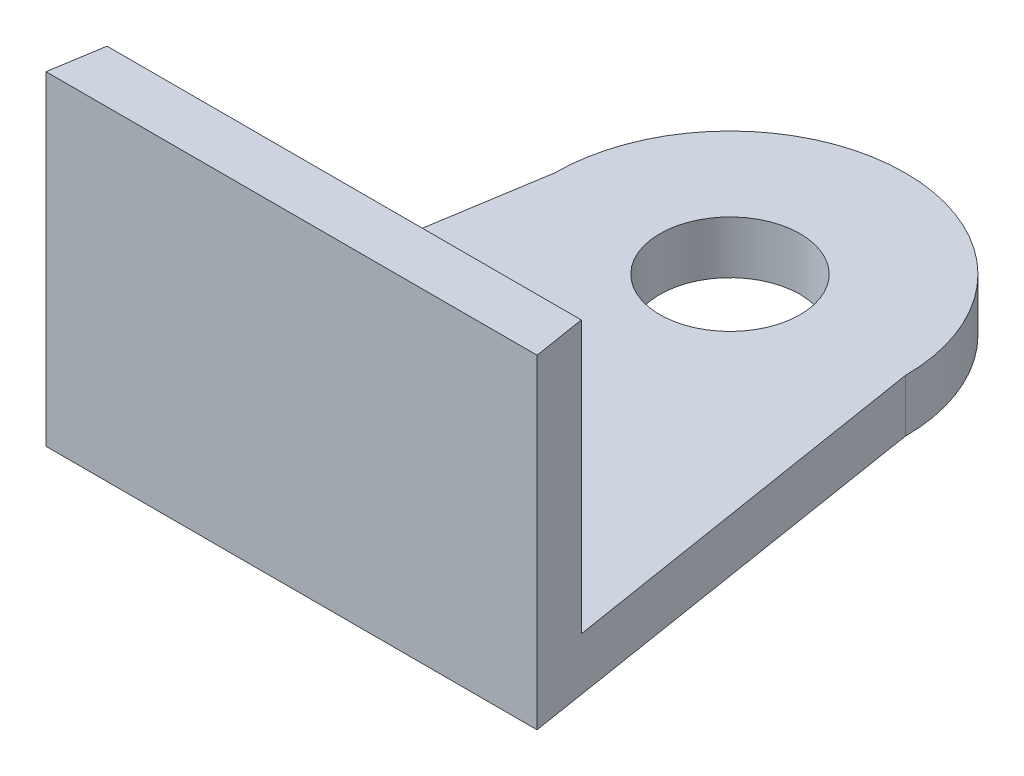
ISO-10303-21;
HEADER;
FILE_DESCRIPTION(('STEP AP214'),'2;1');
FILE_NAME('part.step','',(''),(''),'','','');
FILE_SCHEMA(('AUTOMOTIVE_DESIGN { 1 0 10303 214 1 1 1 1 }'));
ENDSEC;
DATA;
#1=APPLICATION_CONTEXT('core data for automotive mechanical design processes');
#2=APPLICATION_PROTOCOL_DEFINITION('international standard','automotive_design',2000,#1);
#3=PRODUCT_CONTEXT('',#1,'mechanical');
#4=PRODUCT('Part','Part','',(#3));
#5=PRODUCT_RELATED_PRODUCT_CATEGORY('part','',(#4));
#6=PRODUCT_DEFINITION_FORMATION('','',#4);
#7=PRODUCT_DEFINITION_CONTEXT('part definition',#1,'design');
#8=PRODUCT_DEFINITION('design','',#6,#7);
#9=PRODUCT_DEFINITION_SHAPE('','',#8);
#10=(LENGTH_UNIT() NAMED_UNIT(*) SI_UNIT(.MILLI.,.METRE.));
#11=(NAMED_UNIT(*) PLANE_ANGLE_UNIT() SI_UNIT($,.RADIAN.));
#12=(NAMED_UNIT(*) SI_UNIT($,.STERADIAN.) SOLID_ANGLE_UNIT());
#13=UNCERTAINTY_MEASURE_WITH_UNIT(LENGTH_MEASURE(1.E-05),#10,'distance_accuracy_value','');
#14=(GEOMETRIC_REPRESENTATION_CONTEXT(3) GLOBAL_UNCERTAINTY_ASSIGNED_CONTEXT((#13)) GLOBAL_UNIT_ASSIGNED_CONTEXT((#10,
#11,#12)) REPRESENTATION_CONTEXT('',''));
#15=CARTESIAN_POINT('',(0.,0.,0.));
#16=DIRECTION('',(0.,0.,1.));
#17=DIRECTION('',(1.,0.,0.));
#18=AXIS2_PLACEMENT_3D('',#15,#16,#17);
#19=CARTESIAN_POINT('',(0.,-10.,0.));
#20=DIRECTION('',(0.,1.,0.));
#21=DIRECTION('',(0.,0.,1.));
#22=AXIS2_PLACEMENT_3D('',#19,#20,#21);
#23=CYLINDRICAL_SURFACE('',#22,4.);
#24=CARTESIAN_POINT('',(0.,0.,0.));
#25=DIRECTION('',(0.,-1.,0.));
#26=DIRECTION('',(0.,0.,-1.));
#27=AXIS2_PLACEMENT_3D('',#24,#25,#26);
#28=CIRCLE('',#27,4.);
#29=CARTESIAN_POINT('',(0.,0.,-4.));
#30=VERTEX_POINT('',#29);
#31=EDGE_CURVE('E98',#30,#30,#28,.T.);
#32=ORIENTED_EDGE('',*,*,#31,.T.);
#33=EDGE_LOOP('',(#32));
#34=FACE_BOUND('',#33,.T.);
#35=CARTESIAN_POINT('',(0.,3.,0.));
#36=DIRECTION('',(0.,-1.,0.));
#37=DIRECTION('',(0.,0.,-1.));
#38=AXIS2_PLACEMENT_3D('',#35,#36,#37);
#39=CIRCLE('',#38,4.);
#40=CARTESIAN_POINT('',(0.,3.,-4.));
#41=VERTEX_POINT('',#40);
#42=EDGE_CURVE('E124',#41,#41,#39,.T.);
#43=ORIENTED_EDGE('',*,*,#42,.F.);
#44=EDGE_LOOP('',(#43));
#45=FACE_BOUND('',#44,.T.);
#46=ADVANCED_FACE('F35',(#34,#45),#23,.F.);
#47=CARTESIAN_POINT('',(0.,3.,0.));
#48=DIRECTION('',(0.,-1.,0.));
#49=DIRECTION('',(0.,0.,-1.));
#50=AXIS2_PLACEMENT_3D('',#47,#48,#49);
#51=PLANE('',#50);
#52=DIRECTION('',(-1.,0.,0.));
#53=VECTOR('',#52,1.);
#54=CARTESIAN_POINT('',(-13.52,3.,22.));
#55=LINE('',#54,#53);
#56=CARTESIAN_POINT('',(13.52,3.,22.));
#57=VERTEX_POINT('',#56);
#58=CARTESIAN_POINT('',(-13.52,3.,22.));
#59=VERTEX_POINT('',#58);
#60=EDGE_CURVE('E52',#57,#59,#55,.T.);
#61=ORIENTED_EDGE('',*,*,#60,.F.);
#62=DIRECTION('',(-0.157990501106673,0.,-0.987440631916705));
#63=VECTOR('',#62,1.);
#64=CARTESIAN_POINT('',(10.,3.,0.));
#65=LINE('',#64,#63);
#66=CARTESIAN_POINT('',(10.,3.,0.));
#67=VERTEX_POINT('',#66);
#68=EDGE_CURVE('E57',#57,#67,#65,.T.);
#69=ORIENTED_EDGE('',*,*,#68,.T.);
#70=CARTESIAN_POINT('',(0.,3.,0.));
#71=DIRECTION('',(0.,1.,0.));
#72=DIRECTION('',(0.,0.,-1.));
#73=AXIS2_PLACEMENT_3D('',#70,#71,#72);
#74=CIRCLE('',#73,10.);
#75=CARTESIAN_POINT('',(-10.,3.,0.));
#76=VERTEX_POINT('',#75);
#77=EDGE_CURVE('E88',#67,#76,#74,.T.);
#78=ORIENTED_EDGE('',*,*,#77,.T.);
#79=DIRECTION('',(-0.157990501106673,0.,0.987440631916705));
#80=VECTOR('',#79,1.);
#81=CARTESIAN_POINT('',(-10.,3.,0.));
#82=LINE('',#81,#80);
#83=EDGE_CURVE('E112',#76,#59,#82,.T.);
#84=ORIENTED_EDGE('',*,*,#83,.T.);
#85=EDGE_LOOP('',(#61,#69,#78,#84));
#86=FACE_BOUND('',#85,.T.);
#87=ORIENTED_EDGE('',*,*,#42,.T.);
#88=EDGE_LOOP('',(#87));
#89=FACE_BOUND('',#88,.T.);
#90=ADVANCED_FACE('F164',(#86,#89),#51,.F.);
#91=CARTESIAN_POINT('',(0.,3.,0.));
#92=DIRECTION('',(0.,-1.,0.));
#93=DIRECTION('',(0.,0.,-1.));
#94=AXIS2_PLACEMENT_3D('',#91,#92,#93);
#95=CYLINDRICAL_SURFACE('',#94,10.);
#96=CARTESIAN_POINT('',(0.,0.,0.));
#97=DIRECTION('',(0.,1.,0.));
#98=DIRECTION('',(0.,0.,-1.));
#99=AXIS2_PLACEMENT_3D('',#96,#97,#98);
#100=CIRCLE('',#99,10.);
#101=CARTESIAN_POINT('',(10.,0.,0.));
#102=VERTEX_POINT('',#101);
#103=CARTESIAN_POINT('',(-10.,0.,0.));
#104=VERTEX_POINT('',#103);
#105=EDGE_CURVE('E94',#102,#104,#100,.T.);
#106=ORIENTED_EDGE('',*,*,#105,.T.);
#107=DIRECTION('',(0.,-1.,0.));
#108=VECTOR('',#107,1.);
#109=CARTESIAN_POINT('',(-10.,3.,0.));
#110=LINE('',#109,#108);
#111=EDGE_CURVE('E11',#76,#104,#110,.T.);
#112=ORIENTED_EDGE('',*,*,#111,.F.);
#113=ORIENTED_EDGE('',*,*,#77,.F.);
#114=DIRECTION('',(0.,-1.,0.));
#115=VECTOR('',#114,1.);
#116=CARTESIAN_POINT('',(10.,3.,0.));
#117=LINE('',#116,#115);
#118=EDGE_CURVE('E80',#67,#102,#117,.T.);
#119=ORIENTED_EDGE('',*,*,#118,.T.);
#120=EDGE_LOOP('',(#106,#112,#113,#119));
#121=FACE_BOUND('',#120,.T.);
#122=ADVANCED_FACE('F37',(#121),#95,.T.);
#123=CARTESIAN_POINT('',(-10.,3.,0.));
#124=DIRECTION('',(0.987440631916705,0.,0.157990501106673));
#125=DIRECTION('',(0.157990501106673,0.,-0.987440631916705));
#126=AXIS2_PLACEMENT_3D('',#123,#124,#125);
#127=PLANE('',#126);
#128=DIRECTION('',(-0.157990501106673,0.,0.987440631916705));
#129=VECTOR('',#128,1.);
#130=CARTESIAN_POINT('',(-10.,0.,0.));
#131=LINE('',#130,#129);
#132=CARTESIAN_POINT('',(-14.,0.,25.));
#133=VERTEX_POINT('',#132);
#134=EDGE_CURVE('E97',#104,#133,#131,.T.);
#135=ORIENTED_EDGE('',*,*,#134,.T.);
#136=DIRECTION('',(0.,-1.,0.));
#137=VECTOR('',#136,1.);
#138=CARTESIAN_POINT('',(-14.,3.,25.));
#139=LINE('',#138,#137);
#140=CARTESIAN_POINT('',(-14.,18.5,25.));
#141=VERTEX_POINT('',#140);
#142=EDGE_CURVE('E44',#141,#133,#139,.T.);
#143=ORIENTED_EDGE('',*,*,#142,.F.);
#144=DIRECTION('',(-0.157990501106673,0.,0.987440631916705));
#145=VECTOR('',#144,1.);
#146=CARTESIAN_POINT('',(-13.52,18.5,22.));
#147=LINE('',#146,#145);
#148=CARTESIAN_POINT('',(-13.52,18.5,22.));
#149=VERTEX_POINT('',#148);
#150=EDGE_CURVE('E123',#149,#141,#147,.T.);
#151=ORIENTED_EDGE('',*,*,#150,.F.);
#152=DIRECTION('',(0.,-1.,0.));
#153=VECTOR('',#152,1.);
#154=CARTESIAN_POINT('',(-13.52,18.5,22.));
#155=LINE('',#154,#153);
#156=EDGE_CURVE('E125',#149,#59,#155,.T.);
#157=ORIENTED_EDGE('',*,*,#156,.T.);
#158=ORIENTED_EDGE('',*,*,#83,.F.);
#159=ORIENTED_EDGE('',*,*,#111,.T.);
#160=EDGE_LOOP('',(#135,#143,#151,#157,#158,#159));
#161=FACE_BOUND('',#160,.T.);
#162=ADVANCED_FACE('F152',(#161),#127,.F.);
#163=CARTESIAN_POINT('',(-14.,3.,25.));
#164=DIRECTION('',(0.,0.,-1.));
#165=DIRECTION('',(-1.,0.,0.));
#166=AXIS2_PLACEMENT_3D('',#163,#164,#165);
#167=PLANE('',#166);
#168=DIRECTION('',(1.,0.,0.));
#169=VECTOR('',#168,1.);
#170=CARTESIAN_POINT('',(-14.,0.,25.));
#171=LINE('',#170,#169);
#172=CARTESIAN_POINT('',(14.,0.,25.));
#173=VERTEX_POINT('',#172);
#174=EDGE_CURVE('E89',#133,#173,#171,.T.);
#175=ORIENTED_EDGE('',*,*,#174,.T.);
#176=DIRECTION('',(0.,-1.,0.));
#177=VECTOR('',#176,1.);
#178=CARTESIAN_POINT('',(14.,3.,25.));
#179=LINE('',#178,#177);
#180=CARTESIAN_POINT('',(14.,18.5,25.));
#181=VERTEX_POINT('',#180);
#182=EDGE_CURVE('E84',#181,#173,#179,.T.);
#183=ORIENTED_EDGE('',*,*,#182,.F.);
#184=DIRECTION('',(1.,0.,0.));
#185=VECTOR('',#184,1.);
#186=CARTESIAN_POINT('',(-14.,18.5,25.));
#187=LINE('',#186,#185);
#188=EDGE_CURVE('E155',#141,#181,#187,.T.);
#189=ORIENTED_EDGE('',*,*,#188,.F.);
#190=ORIENTED_EDGE('',*,*,#142,.T.);
#191=EDGE_LOOP('',(#175,#183,#189,#190));
#192=FACE_BOUND('',#191,.T.);
#193=ADVANCED_FACE('F156',(#192),#167,.F.);
#194=CARTESIAN_POINT('',(10.,3.,0.));
#195=DIRECTION('',(-0.987440631916705,0.,0.157990501106673));
#196=DIRECTION('',(0.157990501106673,0.,0.987440631916705));
#197=AXIS2_PLACEMENT_3D('',#194,#195,#196);
#198=PLANE('',#197);
#199=DIRECTION('',(-0.157990501106673,0.,-0.987440631916705));
#200=VECTOR('',#199,1.);
#201=CARTESIAN_POINT('',(10.,0.,0.));
#202=LINE('',#201,#200);
#203=EDGE_CURVE('E77',#173,#102,#202,.T.);
#204=ORIENTED_EDGE('',*,*,#203,.T.);
#205=ORIENTED_EDGE('',*,*,#118,.F.);
#206=ORIENTED_EDGE('',*,*,#68,.F.);
#207=DIRECTION('',(0.,-1.,0.));
#208=VECTOR('',#207,1.);
#209=CARTESIAN_POINT('',(13.52,18.5,22.));
#210=LINE('',#209,#208);
#211=CARTESIAN_POINT('',(13.52,18.5,22.));
#212=VERTEX_POINT('',#211);
#213=EDGE_CURVE('E102',#212,#57,#210,.T.);
#214=ORIENTED_EDGE('',*,*,#213,.F.);
#215=DIRECTION('',(-0.157990501106673,0.,-0.987440631916705));
#216=VECTOR('',#215,1.);
#217=CARTESIAN_POINT('',(14.,18.5,25.));
#218=LINE('',#217,#216);
#219=EDGE_CURVE('E140',#181,#212,#218,.T.);
#220=ORIENTED_EDGE('',*,*,#219,.F.);
#221=ORIENTED_EDGE('',*,*,#182,.T.);
#222=EDGE_LOOP('',(#204,#205,#206,#214,#220,#221));
#223=FACE_BOUND('',#222,.T.);
#224=ADVANCED_FACE('F79',(#223),#198,.F.);
#225=CARTESIAN_POINT('',(0.,0.,0.));
#226=DIRECTION('',(0.,-1.,0.));
#227=DIRECTION('',(0.,0.,-1.));
#228=AXIS2_PLACEMENT_3D('',#225,#226,#227);
#229=PLANE('',#228);
#230=ORIENTED_EDGE('',*,*,#31,.F.);
#231=EDGE_LOOP('',(#230));
#232=FACE_BOUND('',#231,.T.);
#233=ORIENTED_EDGE('',*,*,#105,.F.);
#234=ORIENTED_EDGE('',*,*,#203,.F.);
#235=ORIENTED_EDGE('',*,*,#174,.F.);
#236=ORIENTED_EDGE('',*,*,#134,.F.);
#237=EDGE_LOOP('',(#233,#234,#235,#236));
#238=FACE_BOUND('',#237,.T.);
#239=ADVANCED_FACE('F96',(#232,#238),#229,.T.);
#240=CARTESIAN_POINT('',(-13.52,18.5,22.));
#241=DIRECTION('',(0.,0.,1.));
#242=DIRECTION('',(1.,0.,0.));
#243=AXIS2_PLACEMENT_3D('',#240,#241,#242);
#244=PLANE('',#243);
#245=ORIENTED_EDGE('',*,*,#60,.T.);
#246=ORIENTED_EDGE('',*,*,#156,.F.);
#247=DIRECTION('',(-1.,0.,0.));
#248=VECTOR('',#247,1.);
#249=CARTESIAN_POINT('',(-13.52,18.5,22.));
#250=LINE('',#249,#248);
#251=EDGE_CURVE('E120',#212,#149,#250,.T.);
#252=ORIENTED_EDGE('',*,*,#251,.F.);
#253=ORIENTED_EDGE('',*,*,#213,.T.);
#254=EDGE_LOOP('',(#245,#246,#252,#253));
#255=FACE_BOUND('',#254,.T.);
#256=ADVANCED_FACE('F133',(#255),#244,.F.);
#257=CARTESIAN_POINT('',(0.,18.5,0.));
#258=DIRECTION('',(0.,1.,0.));
#259=DIRECTION('',(0.,0.,1.));
#260=AXIS2_PLACEMENT_3D('',#257,#258,#259);
#261=PLANE('',#260);
#262=ORIENTED_EDGE('',*,*,#150,.T.);
#263=ORIENTED_EDGE('',*,*,#188,.T.);
#264=ORIENTED_EDGE('',*,*,#219,.T.);
#265=ORIENTED_EDGE('',*,*,#251,.T.);
#266=EDGE_LOOP('',(#262,#263,#264,#265));
#267=FACE_BOUND('',#266,.T.);
#268=ADVANCED_FACE('F158',(#267),#261,.T.);
#269=CLOSED_SHELL('',(#46,#90,#122,#162,#193,#224,#239,#256,#268));
#270=MANIFOLD_SOLID_BREP('B2',#269);
#271=ADVANCED_BREP_SHAPE_REPRESENTATION('',(#18,#270),#14);
#272=SHAPE_DEFINITION_REPRESENTATION(#9,#271);
ENDSEC;
END-ISO-10303-21;
